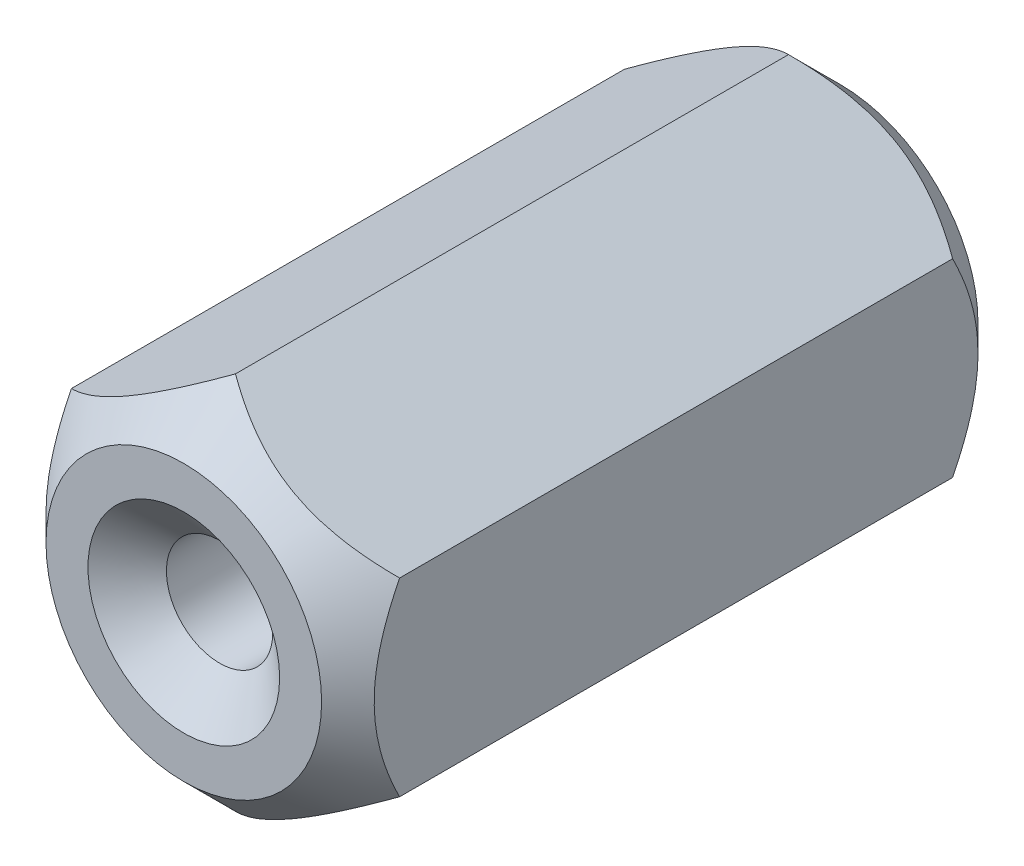
ISO-10303-21;
HEADER;
FILE_DESCRIPTION(('STEP AP214'),'2;1');
FILE_NAME('part.step','',(''),(''),'','','');
FILE_SCHEMA(('AUTOMOTIVE_DESIGN { 1 0 10303 214 1 1 1 1 }'));
ENDSEC;
DATA;
#1=APPLICATION_CONTEXT('core data for automotive mechanical design processes');
#2=APPLICATION_PROTOCOL_DEFINITION('international standard','automotive_design',2000,#1);
#3=PRODUCT_CONTEXT('',#1,'mechanical');
#4=PRODUCT('Part','Part','',(#3));
#5=PRODUCT_RELATED_PRODUCT_CATEGORY('part','',(#4));
#6=PRODUCT_DEFINITION_FORMATION('','',#4);
#7=PRODUCT_DEFINITION_CONTEXT('part definition',#1,'design');
#8=PRODUCT_DEFINITION('design','',#6,#7);
#9=PRODUCT_DEFINITION_SHAPE('','',#8);
#10=(LENGTH_UNIT() NAMED_UNIT(*) SI_UNIT(.MILLI.,.METRE.));
#11=(NAMED_UNIT(*) PLANE_ANGLE_UNIT() SI_UNIT($,.RADIAN.));
#12=(NAMED_UNIT(*) SI_UNIT($,.STERADIAN.) SOLID_ANGLE_UNIT());
#13=UNCERTAINTY_MEASURE_WITH_UNIT(LENGTH_MEASURE(1.E-05),#10,'distance_accuracy_value','');
#14=(GEOMETRIC_REPRESENTATION_CONTEXT(3) GLOBAL_UNCERTAINTY_ASSIGNED_CONTEXT((#13)) GLOBAL_UNIT_ASSIGNED_CONTEXT((#10,
#11,#12)) REPRESENTATION_CONTEXT('',''));
#15=CARTESIAN_POINT('',(0.,0.,0.));
#16=DIRECTION('',(0.,0.,1.));
#17=DIRECTION('',(1.,0.,0.));
#18=AXIS2_PLACEMENT_3D('',#15,#16,#17);
#19=CARTESIAN_POINT('',(0.,-3.66617420935412,-6.35));
#20=DIRECTION('',(0.5,-0.866025403784439,0.));
#21=DIRECTION('',(0.866025403784439,0.5,0.));
#22=AXIS2_PLACEMENT_3D('',#19,#20,#21);
#23=PLANE('',#22);
#24=CARTESIAN_POINT('',(3.1752,-1.83297163462322,-5.34988452449106));
#25=CARTESIAN_POINT('',(3.06606165005017,-1.89598269034567,-5.41284101630822));
#26=CARTESIAN_POINT('',(2.95509837192205,-1.9600473688431,-5.47209989576525));
#27=CARTESIAN_POINT('',(2.72883215365405,-2.09068223086865,-5.58060134426944));
#28=CARTESIAN_POINT('',(2.61350769674773,-2.15726483710766,-5.62978354606129));
#29=CARTESIAN_POINT('',(2.38096147751937,-2.29152545937819,-5.71403354112599));
#30=CARTESIAN_POINT('',(2.26379893371885,-2.35916928558036,-5.74931308550055));
#31=CARTESIAN_POINT('',(2.02689455535371,-2.49594609220167,-5.80366842986518));
#32=CARTESIAN_POINT('',(1.90715995735644,-2.56507489458671,-5.82278480247036));
#33=CARTESIAN_POINT('',(1.70080208124841,-2.68421566990708,-5.84003286937675));
#34=CARTESIAN_POINT('',(1.61444529227084,-2.73407378526963,-5.84258606638617));
#35=CARTESIAN_POINT('',(1.44187218347527,-2.83370891608764,-5.83828372687673));
#36=CARTESIAN_POINT('',(1.35565592350718,-2.88348589698874,-5.83142489197855));
#37=CARTESIAN_POINT('',(1.18404020841286,-2.98256827629562,-5.80869011669629));
#38=CARTESIAN_POINT('',(1.09864177574671,-3.03187308438379,-5.79280409031271));
#39=CARTESIAN_POINT('',(0.929311596694509,-3.12963590884151,-5.75288201600204));
#40=CARTESIAN_POINT('',(0.845379738380234,-3.17809398983284,-5.72884659291482));
#41=CARTESIAN_POINT('',(0.696376420715867,-3.26412109539651,-5.67939476558282));
#42=CARTESIAN_POINT('',(0.630975148808252,-3.30188053733772,-5.655278280699));
#43=CARTESIAN_POINT('',(0.50134674979488,-3.37672152840271,-5.60315853286284));
#44=CARTESIAN_POINT('',(0.437119658558265,-3.41380305681743,-5.57515515139647));
#45=CARTESIAN_POINT('',(0.310041965487392,-3.4871713971199,-5.51588943445548));
#46=CARTESIAN_POINT('',(0.247187749251269,-3.52346029578353,-5.48463734664579));
#47=CARTESIAN_POINT('',(0.122643379151904,-3.59536602138645,-5.41928465560806));
#48=CARTESIAN_POINT('',(0.0609525390212889,-3.63098324454239,-5.38518580048145));
#49=CARTESIAN_POINT('',(-0.000200000000000083,-3.66628967940796,-5.34988452449106));
#50=B_SPLINE_CURVE_WITH_KNOTS('',3,(#24,#25,#26,#27,#28,#29,#30,#31,#32,#33,#34,#35,#36,#37,#38,
#39,#40,#41,#42,#43,#44,#45,#46,#47,#48,#49),.UNSPECIFIED.,.F.,.F.,(4,2,2,2,2,2,2,2,2,2,2,2,4),
(0.,0.422910572436809,0.848285055427811,1.26690402276128,1.68446903107507,1.98329272958353,
2.28222117546891,2.58148426995467,2.88072442418454,3.11844134429547,3.35616551414406,
3.59316134346767,3.83001269744429),.UNSPECIFIED.);
#51=CARTESIAN_POINT('',(3.175,-1.83308710467706,-5.35));
#52=VERTEX_POINT('',#51);
#53=CARTESIAN_POINT('',(0.,-3.66617420935412,-5.35));
#54=VERTEX_POINT('',#53);
#55=EDGE_CURVE('E195',#52,#54,#50,.T.);
#56=ORIENTED_EDGE('',*,*,#55,.F.);
#57=DIRECTION('',(0.,0.,1.));
#58=VECTOR('',#57,1.);
#59=CARTESIAN_POINT('',(3.175,-1.83308710467706,-6.35));
#60=LINE('',#59,#58);
#61=CARTESIAN_POINT('',(3.175,-1.83308710467706,5.35));
#62=VERTEX_POINT('',#61);
#63=EDGE_CURVE('E36',#52,#62,#60,.T.);
#64=ORIENTED_EDGE('',*,*,#63,.T.);
#65=CARTESIAN_POINT('',(-0.000200000000000596,-3.66628967940796,5.34988452449106));
#66=CARTESIAN_POINT('',(0.108938349949826,-3.60327862368552,5.41284101630822));
#67=CARTESIAN_POINT('',(0.219901628077946,-3.53921394518808,5.47209989576525));
#68=CARTESIAN_POINT('',(0.446167846345949,-3.40857908316253,5.58060134426944));
#69=CARTESIAN_POINT('',(0.561492303252266,-3.34199647692352,5.62978354606129));
#70=CARTESIAN_POINT('',(0.79403852248063,-3.207735854653,5.714033541126));
#71=CARTESIAN_POINT('',(0.911201066281155,-3.14009202845082,5.74931308550055));
#72=CARTESIAN_POINT('',(1.14810544464629,-3.00331522182951,5.80366842986518));
#73=CARTESIAN_POINT('',(1.26784004264356,-2.93418641944448,5.82278480247036));
#74=CARTESIAN_POINT('',(1.47419791875159,-2.81504564412411,5.84003286937675));
#75=CARTESIAN_POINT('',(1.56055470772916,-2.76518752876155,5.84258606638617));
#76=CARTESIAN_POINT('',(1.73312781652473,-2.66555239794354,5.83828372687673));
#77=CARTESIAN_POINT('',(1.81934407649282,-2.61577541704245,5.83142489197855));
#78=CARTESIAN_POINT('',(1.99095979158714,-2.51669303773557,5.80869011669629));
#79=CARTESIAN_POINT('',(2.07635822425329,-2.46738822964739,5.79280409031271));
#80=CARTESIAN_POINT('',(2.24568840330549,-2.36962540518968,5.75288201600204));
#81=CARTESIAN_POINT('',(2.32962026161977,-2.32116732419835,5.72884659291482));
#82=CARTESIAN_POINT('',(2.47862357928413,-2.23514021863468,5.67939476558282));
#83=CARTESIAN_POINT('',(2.54402485119175,-2.19738077669347,5.655278280699));
#84=CARTESIAN_POINT('',(2.67365325020512,-2.12253978562848,5.60315853286284));
#85=CARTESIAN_POINT('',(2.73788034144173,-2.08545825721375,5.57515515139647));
#86=CARTESIAN_POINT('',(2.86495803451261,-2.01208991691129,5.51588943445548));
#87=CARTESIAN_POINT('',(2.92781225074873,-1.97580101824766,5.48463734664579));
#88=CARTESIAN_POINT('',(3.0523566208481,-1.90389529264474,5.41928465560806));
#89=CARTESIAN_POINT('',(3.11404746097871,-1.8682780694888,5.38518580048145));
#90=CARTESIAN_POINT('',(3.1752,-1.83297163462322,5.34988452449105));
#91=B_SPLINE_CURVE_WITH_KNOTS('',3,(#65,#66,#67,#68,#69,#70,#71,#72,#73,#74,#75,#76,#77,#78,#79,
#80,#81,#82,#83,#84,#85,#86,#87,#88,#89,#90),.UNSPECIFIED.,.F.,.F.,(4,2,2,2,2,2,2,2,2,2,2,2,4),
(0.,0.422910572436811,0.848285055427812,1.26690402276128,1.68446903107507,1.98329272958353,
2.28222117546892,2.58148426995467,2.88072442418454,3.11844134429548,3.35616551414406,
3.59316134346767,3.83001269744429),.UNSPECIFIED.);
#92=CARTESIAN_POINT('',(0.,-3.66617420935412,5.35));
#93=VERTEX_POINT('',#92);
#94=EDGE_CURVE('E116',#93,#62,#91,.T.);
#95=ORIENTED_EDGE('',*,*,#94,.F.);
#96=DIRECTION('',(0.,0.,1.));
#97=VECTOR('',#96,1.);
#98=CARTESIAN_POINT('',(0.,-3.66617420935412,-6.35));
#99=LINE('',#98,#97);
#100=EDGE_CURVE('E11',#54,#93,#99,.T.);
#101=ORIENTED_EDGE('',*,*,#100,.F.);
#102=EDGE_LOOP('',(#56,#64,#95,#101));
#103=FACE_BOUND('',#102,.T.);
#104=ADVANCED_FACE('F32',(#103),#23,.T.);
#105=CARTESIAN_POINT('',(-3.175,-1.83308710467706,-6.35));
#106=DIRECTION('',(-0.5,-0.866025403784439,0.));
#107=DIRECTION('',(0.866025403784439,-0.5,0.));
#108=AXIS2_PLACEMENT_3D('',#105,#106,#107);
#109=PLANE('',#108);
#110=CARTESIAN_POINT('',(0.000199999999999404,-3.66628967940796,-5.34988452449106));
#111=CARTESIAN_POINT('',(-0.108938349949827,-3.60327862368552,-5.41284101630822));
#112=CARTESIAN_POINT('',(-0.219901628077947,-3.53921394518808,-5.47209989576526));
#113=CARTESIAN_POINT('',(-0.44616784634595,-3.40857908316253,-5.58060134426944));
#114=CARTESIAN_POINT('',(-0.561492303252266,-3.34199647692352,-5.62978354606129));
#115=CARTESIAN_POINT('',(-0.794038522480631,-3.207735854653,-5.71403354112599));
#116=CARTESIAN_POINT('',(-0.911201066281155,-3.14009202845082,-5.74931308550055));
#117=CARTESIAN_POINT('',(-1.14810544464629,-3.00331522182951,-5.80366842986518));
#118=CARTESIAN_POINT('',(-1.26784004264356,-2.93418641944448,-5.82278480247036));
#119=CARTESIAN_POINT('',(-1.47419791875159,-2.81504564412411,-5.84003286937675));
#120=CARTESIAN_POINT('',(-1.56055470772916,-2.76518752876155,-5.84258606638617));
#121=CARTESIAN_POINT('',(-1.73312781652473,-2.66555239794354,-5.83828372687673));
#122=CARTESIAN_POINT('',(-1.81934407649282,-2.61577541704245,-5.83142489197855));
#123=CARTESIAN_POINT('',(-1.99095979158714,-2.51669303773556,-5.80869011669629));
#124=CARTESIAN_POINT('',(-2.07635822425329,-2.46738822964739,-5.79280409031272));
#125=CARTESIAN_POINT('',(-2.24568840330549,-2.36962540518968,-5.75288201600204));
#126=CARTESIAN_POINT('',(-2.32962026161977,-2.32116732419835,-5.72884659291482));
#127=CARTESIAN_POINT('',(-2.47862357928413,-2.23514021863468,-5.67939476558283));
#128=CARTESIAN_POINT('',(-2.54402485119175,-2.19738077669347,-5.655278280699));
#129=CARTESIAN_POINT('',(-2.67365325020512,-2.12253978562848,-5.60315853286284));
#130=CARTESIAN_POINT('',(-2.73788034144173,-2.08545825721375,-5.57515515139647));
#131=CARTESIAN_POINT('',(-2.86495803451261,-2.01208991691129,-5.51588943445549));
#132=CARTESIAN_POINT('',(-2.92781225074873,-1.97580101824766,-5.48463734664579));
#133=CARTESIAN_POINT('',(-3.0523566208481,-1.90389529264474,-5.41928465560807));
#134=CARTESIAN_POINT('',(-3.11404746097871,-1.86827806948879,-5.38518580048146));
#135=CARTESIAN_POINT('',(-3.1752,-1.83297163462322,-5.34988452449106));
#136=B_SPLINE_CURVE_WITH_KNOTS('',3,(#110,#111,#112,#113,#114,#115,#116,#117,#118,#119,#120,
#121,#122,#123,#124,#125,#126,#127,#128,#129,#130,#131,#132,#133,#134,#135),.UNSPECIFIED.,.F.,
.F.,(4,2,2,2,2,2,2,2,2,2,2,2,4),(0.,0.42291057243681,0.848285055427812,1.26690402276128,
1.68446903107507,1.98329272958353,2.28222117546892,2.58148426995467,2.88072442418454,
3.11844134429547,3.35616551414406,3.59316134346767,3.83001269744429),.UNSPECIFIED.);
#137=CARTESIAN_POINT('',(-3.175,-1.83308710467706,-5.35));
#138=VERTEX_POINT('',#137);
#139=EDGE_CURVE('E91',#54,#138,#136,.T.);
#140=ORIENTED_EDGE('',*,*,#139,.F.);
#141=ORIENTED_EDGE('',*,*,#100,.T.);
#142=CARTESIAN_POINT('',(-3.1752,-1.83297163462322,5.34988452449106));
#143=CARTESIAN_POINT('',(-3.06606165005017,-1.89598269034567,5.41284101630822));
#144=CARTESIAN_POINT('',(-2.95509837192205,-1.9600473688431,5.47209989576525));
#145=CARTESIAN_POINT('',(-2.72883215365405,-2.09068223086865,5.58060134426944));
#146=CARTESIAN_POINT('',(-2.61350769674773,-2.15726483710766,5.62978354606129));
#147=CARTESIAN_POINT('',(-2.38096147751937,-2.29152545937819,5.714033541126));
#148=CARTESIAN_POINT('',(-2.26379893371885,-2.35916928558036,5.74931308550055));
#149=CARTESIAN_POINT('',(-2.02689455535372,-2.49594609220167,5.80366842986518));
#150=CARTESIAN_POINT('',(-1.90715995735644,-2.56507489458671,5.82278480247036));
#151=CARTESIAN_POINT('',(-1.70080208124841,-2.68421566990708,5.84003286937675));
#152=CARTESIAN_POINT('',(-1.61444529227084,-2.73407378526963,5.84258606638617));
#153=CARTESIAN_POINT('',(-1.44187218347528,-2.83370891608764,5.83828372687673));
#154=CARTESIAN_POINT('',(-1.35565592350719,-2.88348589698874,5.83142489197855));
#155=CARTESIAN_POINT('',(-1.18404020841286,-2.98256827629562,5.80869011669629));
#156=CARTESIAN_POINT('',(-1.09864177574671,-3.03187308438379,5.79280409031272));
#157=CARTESIAN_POINT('',(-0.929311596694513,-3.12963590884151,5.75288201600204));
#158=CARTESIAN_POINT('',(-0.845379738380237,-3.17809398983284,5.72884659291482));
#159=CARTESIAN_POINT('',(-0.696376420715871,-3.26412109539651,5.67939476558283));
#160=CARTESIAN_POINT('',(-0.630975148808255,-3.30188053733771,5.655278280699));
#161=CARTESIAN_POINT('',(-0.501346749794882,-3.3767215284027,5.60315853286284));
#162=CARTESIAN_POINT('',(-0.437119658558267,-3.41380305681743,5.57515515139647));
#163=CARTESIAN_POINT('',(-0.310041965487393,-3.4871713971199,5.51588943445549));
#164=CARTESIAN_POINT('',(-0.247187749251271,-3.52346029578352,5.48463734664579));
#165=CARTESIAN_POINT('',(-0.122643379151905,-3.59536602138645,5.41928465560806));
#166=CARTESIAN_POINT('',(-0.0609525390212896,-3.63098324454239,5.38518580048145));
#167=CARTESIAN_POINT('',(0.000199999999999347,-3.66628967940796,5.34988452449106));
#168=B_SPLINE_CURVE_WITH_KNOTS('',3,(#142,#143,#144,#145,#146,#147,#148,#149,#150,#151,#152,
#153,#154,#155,#156,#157,#158,#159,#160,#161,#162,#163,#164,#165,#166,#167),.UNSPECIFIED.,.F.,
.F.,(4,2,2,2,2,2,2,2,2,2,2,2,4),(0.,0.422910572436809,0.84828505542781,1.26690402276128,
1.68446903107507,1.98329272958352,2.28222117546891,2.58148426995467,2.88072442418453,
3.11844134429547,3.35616551414406,3.59316134346767,3.83001269744429),.UNSPECIFIED.);
#169=CARTESIAN_POINT('',(-3.175,-1.83308710467706,5.35));
#170=VERTEX_POINT('',#169);
#171=EDGE_CURVE('E117',#170,#93,#168,.T.);
#172=ORIENTED_EDGE('',*,*,#171,.F.);
#173=DIRECTION('',(0.,0.,1.));
#174=VECTOR('',#173,1.);
#175=CARTESIAN_POINT('',(-3.175,-1.83308710467706,-6.35));
#176=LINE('',#175,#174);
#177=EDGE_CURVE('E41',#138,#170,#176,.T.);
#178=ORIENTED_EDGE('',*,*,#177,.F.);
#179=EDGE_LOOP('',(#140,#141,#172,#178));
#180=FACE_BOUND('',#179,.T.);
#181=ADVANCED_FACE('F176',(#180),#109,.T.);
#182=CARTESIAN_POINT('',(-3.175,1.83308710467706,-6.35));
#183=DIRECTION('',(-1.,0.,0.));
#184=DIRECTION('',(0.,-1.,0.));
#185=AXIS2_PLACEMENT_3D('',#182,#183,#184);
#186=PLANE('',#185);
#187=CARTESIAN_POINT('',(-3.175,-3.62314366162436,-4.19872727215091));
#188=CARTESIAN_POINT('',(-3.175,-3.53477477471413,-4.26517330066197));
#189=CARTESIAN_POINT('',(-3.175,-3.44590747401783,-4.33096732929088));
#190=CARTESIAN_POINT('',(-3.175,-3.26698086109358,-4.46096065674581));
#191=CARTESIAN_POINT('',(-3.175,-3.17692125186334,-4.52515954631578));
#192=CARTESIAN_POINT('',(-3.175,-2.9947562299698,-4.65212801376402));
#193=CARTESIAN_POINT('',(-3.175,-2.90264037042889,-4.71488265440275));
#194=CARTESIAN_POINT('',(-3.175,-2.71683951537136,-4.8380168325571));
#195=CARTESIAN_POINT('',(-3.175,-2.62315463201829,-4.89839653882316));
#196=CARTESIAN_POINT('',(-3.175,-2.42867521304995,-5.01955311497214));
#197=CARTESIAN_POINT('',(-3.175,-2.327776197965,-5.08016312895682));
#198=CARTESIAN_POINT('',(-3.175,-2.1236266416231,-5.19734891241029));
#199=CARTESIAN_POINT('',(-3.175,-2.02037573570296,-5.25392405057173));
#200=CARTESIAN_POINT('',(-3.175,-1.81153946353305,-5.36181638181168));
#201=CARTESIAN_POINT('',(-3.175,-1.70596214797143,-5.41314903574252));
#202=CARTESIAN_POINT('',(-3.175,-1.49194968831593,-5.50940753599678));
#203=CARTESIAN_POINT('',(-3.175,-1.38351585328126,-5.55433625855787));
#204=CARTESIAN_POINT('',(-3.175,-1.17206906194383,-5.63305402653428));
#205=CARTESIAN_POINT('',(-3.175,-1.06927808219159,-5.6674331189904));
#206=CARTESIAN_POINT('',(-3.175,-0.861249989752693,-5.72794018821902));
#207=CARTESIAN_POINT('',(-3.175,-0.756012706347597,-5.75406758726936));
#208=CARTESIAN_POINT('',(-3.175,-0.545455116385145,-5.79628154980003));
#209=CARTESIAN_POINT('',(-3.175,-0.440169465308187,-5.81253816718227));
#210=CARTESIAN_POINT('',(-3.175,-0.228508692793317,-5.83470019179704));
#211=CARTESIAN_POINT('',(-3.175,-0.122133754622792,-5.84060731241113));
#212=CARTESIAN_POINT('',(-3.175,0.0869577968377134,-5.84164473816365));
#213=CARTESIAN_POINT('',(-3.175,0.189672720284837,-5.83714340706931));
#214=CARTESIAN_POINT('',(-3.175,0.394206632826209,-5.81841780352249));
#215=CARTESIAN_POINT('',(-3.175,0.496025532914315,-5.80419257595037));
#216=CARTESIAN_POINT('',(-3.175,0.699751411908735,-5.76654774602645));
#217=CARTESIAN_POINT('',(-3.175,0.80162922915897,-5.7429728022883));
#218=CARTESIAN_POINT('',(-3.175,1.00316901022372,-5.68787603830061));
#219=CARTESIAN_POINT('',(-3.175,1.10283116972946,-5.65635492293116));
#220=CARTESIAN_POINT('',(-3.175,1.30972972723242,-5.583139745003));
#221=CARTESIAN_POINT('',(-3.175,1.41671377003006,-5.54073954984725));
#222=CARTESIAN_POINT('',(-3.175,1.62788222750015,-5.4494455092361));
#223=CARTESIAN_POINT('',(-3.175,1.73206568079257,-5.40054946728032));
#224=CARTESIAN_POINT('',(-3.175,1.93816752656033,-5.2974201972936));
#225=CARTESIAN_POINT('',(-3.175,2.04007726416977,-5.24316981162604));
#226=CARTESIAN_POINT('',(-3.175,2.24154914453307,-5.13053481703511));
#227=CARTESIAN_POINT('',(-3.175,2.34111165997837,-5.07215087041164));
#228=CARTESIAN_POINT('',(-3.175,2.53328789139579,-4.95505822864378));
#229=CARTESIAN_POINT('',(-3.175,2.62600050272272,-4.89651098750221));
#230=CARTESIAN_POINT('',(-3.175,2.80983442239984,-4.77696182904577));
#231=CARTESIAN_POINT('',(-3.175,2.90095560921207,-4.71595972541707));
#232=CARTESIAN_POINT('',(-3.175,3.08107470813498,-4.59244540123562));
#233=CARTESIAN_POINT('',(-3.175,3.1700838687153,-4.52994952545103));
#234=CARTESIAN_POINT('',(-3.175,3.34688695470738,-4.40331054967444));
#235=CARTESIAN_POINT('',(-3.175,3.43468120733686,-4.33916790704841));
#236=CARTESIAN_POINT('',(-3.175,3.52196693533842,-4.27435218679602));
#237=B_SPLINE_CURVE_WITH_KNOTS('',3,(#187,#188,#189,#190,#191,#192,#193,#194,#195,#196,#197,
#198,#199,#200,#201,#202,#203,#204,#205,#206,#207,#208,#209,#210,#211,#212,#213,#214,#215,#216,
#217,#218,#219,#220,#221,#222,#223,#224,#225,#226,#227,#228,#229,#230,#231,#232,#233,#234,#235,
#236),.UNSPECIFIED.,.F.,.F.,(4,2,2,2,2,2,2,2,2,2,2,2,2,2,2,2,2,2,2,2,2,2,2,2,4),(0.,
0.331695086033258,0.663474412411204,0.997825593478522,1.33215297421855,1.68518935827853,
2.03828085871132,2.39029899374214,2.74215852308448,3.06703502033416,3.39193425797894,
3.71106436530982,4.03014163496714,4.33810010599997,4.64608883028139,4.9594247376372,
5.27273285971666,5.6177025492793,5.96278918493366,6.30901993384334,6.65519533292016,
6.98410375942931,7.31303719597191,7.63929174244195,7.96545663622253),.UNSPECIFIED.);
#238=CARTESIAN_POINT('',(-3.175,1.83308710467706,-5.35));
#239=VERTEX_POINT('',#238);
#240=EDGE_CURVE('E85',#138,#239,#237,.T.);
#241=ORIENTED_EDGE('',*,*,#240,.F.);
#242=ORIENTED_EDGE('',*,*,#177,.T.);
#243=CARTESIAN_POINT('',(-3.175,-3.62314366162436,4.19872727215091));
#244=CARTESIAN_POINT('',(-3.175,-3.53477477471413,4.26517330066197));
#245=CARTESIAN_POINT('',(-3.175,-3.44590747401783,4.33096732929088));
#246=CARTESIAN_POINT('',(-3.175,-3.26698086109358,4.46096065674581));
#247=CARTESIAN_POINT('',(-3.175,-3.17692125186334,4.52515954631578));
#248=CARTESIAN_POINT('',(-3.175,-2.9947562299698,4.65212801376402));
#249=CARTESIAN_POINT('',(-3.175,-2.90264037042889,4.71488265440275));
#250=CARTESIAN_POINT('',(-3.175,-2.71683951537136,4.8380168325571));
#251=CARTESIAN_POINT('',(-3.175,-2.62315463201829,4.89839653882316));
#252=CARTESIAN_POINT('',(-3.175,-2.42867521304995,5.01955311497214));
#253=CARTESIAN_POINT('',(-3.175,-2.327776197965,5.08016312895682));
#254=CARTESIAN_POINT('',(-3.175,-2.1236266416231,5.19734891241029));
#255=CARTESIAN_POINT('',(-3.175,-2.02037573570296,5.25392405057173));
#256=CARTESIAN_POINT('',(-3.175,-1.81153946353305,5.36181638181168));
#257=CARTESIAN_POINT('',(-3.175,-1.70596214797143,5.41314903574252));
#258=CARTESIAN_POINT('',(-3.175,-1.49194968831593,5.50940753599678));
#259=CARTESIAN_POINT('',(-3.175,-1.38351585328126,5.55433625855787));
#260=CARTESIAN_POINT('',(-3.175,-1.17206906194383,5.63305402653428));
#261=CARTESIAN_POINT('',(-3.175,-1.06927808219159,5.6674331189904));
#262=CARTESIAN_POINT('',(-3.175,-0.861249989752693,5.72794018821902));
#263=CARTESIAN_POINT('',(-3.175,-0.756012706347597,5.75406758726936));
#264=CARTESIAN_POINT('',(-3.175,-0.545455116385145,5.79628154980003));
#265=CARTESIAN_POINT('',(-3.175,-0.440169465308187,5.81253816718227));
#266=CARTESIAN_POINT('',(-3.175,-0.228508692793317,5.83470019179704));
#267=CARTESIAN_POINT('',(-3.175,-0.122133754622792,5.84060731241113));
#268=CARTESIAN_POINT('',(-3.175,0.0869577968377134,5.84164473816365));
#269=CARTESIAN_POINT('',(-3.175,0.189672720284837,5.83714340706931));
#270=CARTESIAN_POINT('',(-3.175,0.394206632826209,5.81841780352249));
#271=CARTESIAN_POINT('',(-3.175,0.496025532914315,5.80419257595037));
#272=CARTESIAN_POINT('',(-3.175,0.699751411908735,5.76654774602645));
#273=CARTESIAN_POINT('',(-3.175,0.80162922915897,5.7429728022883));
#274=CARTESIAN_POINT('',(-3.175,1.00316901022372,5.68787603830061));
#275=CARTESIAN_POINT('',(-3.175,1.10283116972946,5.65635492293116));
#276=CARTESIAN_POINT('',(-3.175,1.30972972723242,5.583139745003));
#277=CARTESIAN_POINT('',(-3.175,1.41671377003006,5.54073954984725));
#278=CARTESIAN_POINT('',(-3.175,1.62788222750015,5.4494455092361));
#279=CARTESIAN_POINT('',(-3.175,1.73206568079257,5.40054946728032));
#280=CARTESIAN_POINT('',(-3.175,1.93816752656033,5.2974201972936));
#281=CARTESIAN_POINT('',(-3.175,2.04007726416977,5.24316981162604));
#282=CARTESIAN_POINT('',(-3.175,2.24154914453307,5.13053481703511));
#283=CARTESIAN_POINT('',(-3.175,2.34111165997837,5.07215087041164));
#284=CARTESIAN_POINT('',(-3.175,2.53328789139579,4.95505822864378));
#285=CARTESIAN_POINT('',(-3.175,2.62600050272272,4.89651098750221));
#286=CARTESIAN_POINT('',(-3.175,2.80983442239984,4.77696182904577));
#287=CARTESIAN_POINT('',(-3.175,2.90095560921207,4.71595972541707));
#288=CARTESIAN_POINT('',(-3.175,3.08107470813498,4.59244540123562));
#289=CARTESIAN_POINT('',(-3.175,3.1700838687153,4.52994952545103));
#290=CARTESIAN_POINT('',(-3.175,3.34688695470738,4.40331054967444));
#291=CARTESIAN_POINT('',(-3.175,3.43468120733686,4.33916790704841));
#292=CARTESIAN_POINT('',(-3.175,3.52196693533842,4.27435218679602));
#293=B_SPLINE_CURVE_WITH_KNOTS('',3,(#243,#244,#245,#246,#247,#248,#249,#250,#251,#252,#253,
#254,#255,#256,#257,#258,#259,#260,#261,#262,#263,#264,#265,#266,#267,#268,#269,#270,#271,#272,
#273,#274,#275,#276,#277,#278,#279,#280,#281,#282,#283,#284,#285,#286,#287,#288,#289,#290,#291,
#292),.UNSPECIFIED.,.F.,.F.,(4,2,2,2,2,2,2,2,2,2,2,2,2,2,2,2,2,2,2,2,2,2,2,2,4),(0.,
0.331695086033258,0.663474412411204,0.997825593478522,1.33215297421855,1.68518935827853,
2.03828085871132,2.39029899374214,2.74215852308448,3.06703502033416,3.39193425797894,
3.71106436530982,4.03014163496714,4.33810010599997,4.64608883028139,4.9594247376372,
5.27273285971666,5.6177025492793,5.96278918493366,6.30901993384334,6.65519533292016,
6.98410375942931,7.31303719597191,7.63929174244195,7.96545663622253),.UNSPECIFIED.);
#294=CARTESIAN_POINT('',(-3.175,1.83308710467706,5.35));
#295=VERTEX_POINT('',#294);
#296=EDGE_CURVE('E107',#295,#170,#293,.F.);
#297=ORIENTED_EDGE('',*,*,#296,.F.);
#298=DIRECTION('',(0.,0.,1.));
#299=VECTOR('',#298,1.);
#300=CARTESIAN_POINT('',(-3.175,1.83308710467706,-6.35));
#301=LINE('',#300,#299);
#302=EDGE_CURVE('E100',#239,#295,#301,.T.);
#303=ORIENTED_EDGE('',*,*,#302,.F.);
#304=EDGE_LOOP('',(#241,#242,#297,#303));
#305=FACE_BOUND('',#304,.T.);
#306=ADVANCED_FACE('F105',(#305),#186,.T.);
#307=CARTESIAN_POINT('',(0.,3.66617420935412,-6.35));
#308=DIRECTION('',(-0.5,0.866025403784439,0.));
#309=DIRECTION('',(-0.866025403784439,-0.5,0.));
#310=AXIS2_PLACEMENT_3D('',#307,#308,#309);
#311=PLANE('',#310);
#312=CARTESIAN_POINT('',(-3.1752,1.83297163462323,-5.34988452449106));
#313=CARTESIAN_POINT('',(-3.06606165005017,1.89598269034567,-5.41284101630822));
#314=CARTESIAN_POINT('',(-2.95509837192205,1.9600473688431,-5.47209989576525));
#315=CARTESIAN_POINT('',(-2.72883215365405,2.09068223086865,-5.58060134426944));
#316=CARTESIAN_POINT('',(-2.61350769674773,2.15726483710766,-5.62978354606129));
#317=CARTESIAN_POINT('',(-2.38096147751937,2.29152545937819,-5.71403354112599));
#318=CARTESIAN_POINT('',(-2.26379893371885,2.35916928558036,-5.74931308550055));
#319=CARTESIAN_POINT('',(-2.02689455535371,2.49594609220167,-5.80366842986518));
#320=CARTESIAN_POINT('',(-1.90715995735644,2.56507489458671,-5.82278480247036));
#321=CARTESIAN_POINT('',(-1.70080208124841,2.68421566990708,-5.84003286937675));
#322=CARTESIAN_POINT('',(-1.61444529227084,2.73407378526963,-5.84258606638617));
#323=CARTESIAN_POINT('',(-1.44187218347527,2.83370891608764,-5.83828372687673));
#324=CARTESIAN_POINT('',(-1.35565592350719,2.88348589698874,-5.83142489197855));
#325=CARTESIAN_POINT('',(-1.18404020841286,2.98256827629562,-5.80869011669629));
#326=CARTESIAN_POINT('',(-1.09864177574671,3.03187308438379,-5.79280409031271));
#327=CARTESIAN_POINT('',(-0.929311596694511,3.12963590884151,-5.75288201600204));
#328=CARTESIAN_POINT('',(-0.845379738380236,3.17809398983284,-5.72884659291482));
#329=CARTESIAN_POINT('',(-0.696376420715869,3.26412109539651,-5.67939476558283));
#330=CARTESIAN_POINT('',(-0.630975148808253,3.30188053733771,-5.655278280699));
#331=CARTESIAN_POINT('',(-0.501346749794881,3.3767215284027,-5.60315853286284));
#332=CARTESIAN_POINT('',(-0.437119658558266,3.41380305681743,-5.57515515139647));
#333=CARTESIAN_POINT('',(-0.310041965487392,3.4871713971199,-5.51588943445549));
#334=CARTESIAN_POINT('',(-0.247187749251269,3.52346029578352,-5.48463734664579));
#335=CARTESIAN_POINT('',(-0.122643379151903,3.59536602138645,-5.41928465560806));
#336=CARTESIAN_POINT('',(-0.0609525390212879,3.63098324454239,-5.38518580048145));
#337=CARTESIAN_POINT('',(0.000200000000001174,3.66628967940796,-5.34988452449106));
#338=B_SPLINE_CURVE_WITH_KNOTS('',3,(#312,#313,#314,#315,#316,#317,#318,#319,#320,#321,#322,
#323,#324,#325,#326,#327,#328,#329,#330,#331,#332,#333,#334,#335,#336,#337),.UNSPECIFIED.,.F.,
.F.,(4,2,2,2,2,2,2,2,2,2,2,2,4),(0.,0.422910572436809,0.84828505542781,1.26690402276128,
1.68446903107507,1.98329272958352,2.28222117546891,2.58148426995467,2.88072442418453,
3.11844134429547,3.35616551414406,3.59316134346767,3.83001269744429),.UNSPECIFIED.);
#339=CARTESIAN_POINT('',(0.,3.66617420935412,-5.35));
#340=VERTEX_POINT('',#339);
#341=EDGE_CURVE('E89',#239,#340,#338,.T.);
#342=ORIENTED_EDGE('',*,*,#341,.F.);
#343=ORIENTED_EDGE('',*,*,#302,.T.);
#344=CARTESIAN_POINT('',(0.000200000000001491,3.66628967940796,5.34988452449106));
#345=CARTESIAN_POINT('',(-0.108938349949825,3.60327862368552,5.41284101630822));
#346=CARTESIAN_POINT('',(-0.219901628077945,3.53921394518808,5.47209989576526));
#347=CARTESIAN_POINT('',(-0.446167846345947,3.40857908316253,5.58060134426944));
#348=CARTESIAN_POINT('',(-0.561492303252264,3.34199647692353,5.62978354606129));
#349=CARTESIAN_POINT('',(-0.794038522480629,3.207735854653,5.71403354112599));
#350=CARTESIAN_POINT('',(-0.911201066281153,3.14009202845083,5.74931308550055));
#351=CARTESIAN_POINT('',(-1.14810544464628,3.00331522182952,5.80366842986518));
#352=CARTESIAN_POINT('',(-1.26784004264356,2.93418641944448,5.82278480247036));
#353=CARTESIAN_POINT('',(-1.47419791875159,2.81504564412411,5.84003286937675));
#354=CARTESIAN_POINT('',(-1.56055470772916,2.76518752876155,5.84258606638617));
#355=CARTESIAN_POINT('',(-1.73312781652473,2.66555239794355,5.83828372687673));
#356=CARTESIAN_POINT('',(-1.81934407649281,2.61577541704245,5.83142489197855));
#357=CARTESIAN_POINT('',(-1.99095979158714,2.51669303773557,5.80869011669629));
#358=CARTESIAN_POINT('',(-2.07635822425329,2.4673882296474,5.79280409031271));
#359=CARTESIAN_POINT('',(-2.24568840330549,2.36962540518968,5.75288201600204));
#360=CARTESIAN_POINT('',(-2.32962026161976,2.32116732419835,5.72884659291482));
#361=CARTESIAN_POINT('',(-2.47862357928413,2.23514021863468,5.67939476558282));
#362=CARTESIAN_POINT('',(-2.54402485119175,2.19738077669347,5.655278280699));
#363=CARTESIAN_POINT('',(-2.67365325020512,2.12253978562848,5.60315853286284));
#364=CARTESIAN_POINT('',(-2.73788034144173,2.08545825721375,5.57515515139647));
#365=CARTESIAN_POINT('',(-2.86495803451261,2.01208991691129,5.51588943445548));
#366=CARTESIAN_POINT('',(-2.92781225074873,1.97580101824766,5.48463734664579));
#367=CARTESIAN_POINT('',(-3.0523566208481,1.90389529264474,5.41928465560806));
#368=CARTESIAN_POINT('',(-3.11404746097871,1.8682780694888,5.38518580048145));
#369=CARTESIAN_POINT('',(-3.1752,1.83297163462323,5.34988452449106));
#370=B_SPLINE_CURVE_WITH_KNOTS('',3,(#344,#345,#346,#347,#348,#349,#350,#351,#352,#353,#354,
#355,#356,#357,#358,#359,#360,#361,#362,#363,#364,#365,#366,#367,#368,#369),.UNSPECIFIED.,.F.,
.F.,(4,2,2,2,2,2,2,2,2,2,2,2,4),(0.,0.42291057243681,0.848285055427811,1.26690402276128,
1.68446903107507,1.98329272958353,2.28222117546892,2.58148426995467,2.88072442418454,
3.11844134429548,3.35616551414406,3.59316134346767,3.83001269744429),.UNSPECIFIED.);
#371=CARTESIAN_POINT('',(0.,3.66617420935412,5.35));
#372=VERTEX_POINT('',#371);
#373=EDGE_CURVE('E163',#372,#295,#370,.T.);
#374=ORIENTED_EDGE('',*,*,#373,.F.);
#375=DIRECTION('',(0.,0.,1.));
#376=VECTOR('',#375,1.);
#377=CARTESIAN_POINT('',(0.,3.66617420935412,-6.35));
#378=LINE('',#377,#376);
#379=EDGE_CURVE('E102',#340,#372,#378,.T.);
#380=ORIENTED_EDGE('',*,*,#379,.F.);
#381=EDGE_LOOP('',(#342,#343,#374,#380));
#382=FACE_BOUND('',#381,.T.);
#383=ADVANCED_FACE('F98',(#382),#311,.T.);
#384=CARTESIAN_POINT('',(3.175,1.83308710467706,-6.35));
#385=DIRECTION('',(0.5,0.866025403784438,0.));
#386=DIRECTION('',(-0.866025403784438,0.5,0.));
#387=AXIS2_PLACEMENT_3D('',#384,#385,#386);
#388=PLANE('',#387);
#389=CARTESIAN_POINT('',(-0.000199999999998509,3.66628967940796,-5.34988452449105));
#390=CARTESIAN_POINT('',(0.108938349949828,3.60327862368552,-5.41284101630822));
#391=CARTESIAN_POINT('',(0.219901628077948,3.53921394518808,-5.47209989576525));
#392=CARTESIAN_POINT('',(0.446167846345951,3.40857908316253,-5.58060134426944));
#393=CARTESIAN_POINT('',(0.561492303252268,3.34199647692352,-5.62978354606129));
#394=CARTESIAN_POINT('',(0.794038522480632,3.207735854653,-5.71403354112599));
#395=CARTESIAN_POINT('',(0.911201066281157,3.14009202845082,-5.74931308550055));
#396=CARTESIAN_POINT('',(1.14810544464629,3.00331522182951,-5.80366842986518));
#397=CARTESIAN_POINT('',(1.26784004264356,2.93418641944448,-5.82278480247036));
#398=CARTESIAN_POINT('',(1.47419791875159,2.81504564412411,-5.84003286937675));
#399=CARTESIAN_POINT('',(1.56055470772917,2.76518752876155,-5.84258606638617));
#400=CARTESIAN_POINT('',(1.73312781652473,2.66555239794354,-5.83828372687673));
#401=CARTESIAN_POINT('',(1.81934407649282,2.61577541704245,-5.83142489197855));
#402=CARTESIAN_POINT('',(1.99095979158714,2.51669303773556,-5.80869011669629));
#403=CARTESIAN_POINT('',(2.07635822425329,2.46738822964739,-5.79280409031271));
#404=CARTESIAN_POINT('',(2.24568840330549,2.36962540518968,-5.75288201600204));
#405=CARTESIAN_POINT('',(2.32962026161977,2.32116732419834,-5.72884659291482));
#406=CARTESIAN_POINT('',(2.47862357928413,2.23514021863468,-5.67939476558282));
#407=CARTESIAN_POINT('',(2.54402485119175,2.19738077669347,-5.655278280699));
#408=CARTESIAN_POINT('',(2.67365325020512,2.12253978562848,-5.60315853286284));
#409=CARTESIAN_POINT('',(2.73788034144174,2.08545825721375,-5.57515515139647));
#410=CARTESIAN_POINT('',(2.86495803451261,2.01208991691129,-5.51588943445548));
#411=CARTESIAN_POINT('',(2.92781225074873,1.97580101824766,-5.48463734664579));
#412=CARTESIAN_POINT('',(3.0523566208481,1.90389529264474,-5.41928465560806));
#413=CARTESIAN_POINT('',(3.11404746097871,1.86827806948879,-5.38518580048145));
#414=CARTESIAN_POINT('',(3.1752,1.83297163462322,-5.34988452449106));
#415=B_SPLINE_CURVE_WITH_KNOTS('',3,(#389,#390,#391,#392,#393,#394,#395,#396,#397,#398,#399,
#400,#401,#402,#403,#404,#405,#406,#407,#408,#409,#410,#411,#412,#413,#414),.UNSPECIFIED.,.F.,
.F.,(4,2,2,2,2,2,2,2,2,2,2,2,4),(0.,0.422910572436811,0.848285055427812,1.26690402276128,
1.68446903107507,1.98329272958353,2.28222117546892,2.58148426995467,2.88072442418454,
3.11844134429547,3.35616551414406,3.59316134346767,3.83001269744429),.UNSPECIFIED.);
#416=CARTESIAN_POINT('',(3.175,1.83308710467706,-5.35));
#417=VERTEX_POINT('',#416);
#418=EDGE_CURVE('E49',#340,#417,#415,.T.);
#419=ORIENTED_EDGE('',*,*,#418,.F.);
#420=ORIENTED_EDGE('',*,*,#379,.T.);
#421=CARTESIAN_POINT('',(3.1752,1.83297163462322,5.34988452449106));
#422=CARTESIAN_POINT('',(3.06606165005017,1.89598269034567,5.41284101630822));
#423=CARTESIAN_POINT('',(2.95509837192205,1.9600473688431,5.47209989576525));
#424=CARTESIAN_POINT('',(2.72883215365405,2.09068223086865,5.58060134426944));
#425=CARTESIAN_POINT('',(2.61350769674773,2.15726483710766,5.62978354606129));
#426=CARTESIAN_POINT('',(2.38096147751937,2.29152545937819,5.714033541126));
#427=CARTESIAN_POINT('',(2.26379893371885,2.35916928558036,5.74931308550055));
#428=CARTESIAN_POINT('',(2.02689455535371,2.49594609220167,5.80366842986518));
#429=CARTESIAN_POINT('',(1.90715995735644,2.56507489458671,5.82278480247036));
#430=CARTESIAN_POINT('',(1.70080208124841,2.68421566990708,5.84003286937675));
#431=CARTESIAN_POINT('',(1.61444529227084,2.73407378526963,5.84258606638617));
#432=CARTESIAN_POINT('',(1.44187218347527,2.83370891608764,5.83828372687673));
#433=CARTESIAN_POINT('',(1.35565592350719,2.88348589698874,5.83142489197855));
#434=CARTESIAN_POINT('',(1.18404020841286,2.98256827629562,5.80869011669629));
#435=CARTESIAN_POINT('',(1.09864177574671,3.03187308438379,5.79280409031271));
#436=CARTESIAN_POINT('',(0.929311596694511,3.12963590884151,5.75288201600204));
#437=CARTESIAN_POINT('',(0.845379738380236,3.17809398983284,5.72884659291482));
#438=CARTESIAN_POINT('',(0.696376420715869,3.26412109539651,5.67939476558282));
#439=CARTESIAN_POINT('',(0.630975148808254,3.30188053733771,5.655278280699));
#440=CARTESIAN_POINT('',(0.501346749794882,3.37672152840271,5.60315853286284));
#441=CARTESIAN_POINT('',(0.437119658558267,3.41380305681743,5.57515515139647));
#442=CARTESIAN_POINT('',(0.310041965487394,3.4871713971199,5.51588943445548));
#443=CARTESIAN_POINT('',(0.247187749251271,3.52346029578353,5.48463734664579));
#444=CARTESIAN_POINT('',(0.122643379151905,3.59536602138645,5.41928465560806));
#445=CARTESIAN_POINT('',(0.0609525390212904,3.63098324454239,5.38518580048145));
#446=CARTESIAN_POINT('',(-0.000199999999998456,3.66628967940796,5.34988452449105));
#447=B_SPLINE_CURVE_WITH_KNOTS('',3,(#421,#422,#423,#424,#425,#426,#427,#428,#429,#430,#431,
#432,#433,#434,#435,#436,#437,#438,#439,#440,#441,#442,#443,#444,#445,#446),.UNSPECIFIED.,.F.,
.F.,(4,2,2,2,2,2,2,2,2,2,2,2,4),(0.,0.42291057243681,0.848285055427811,1.26690402276128,
1.68446903107507,1.98329272958353,2.28222117546892,2.58148426995467,2.88072442418453,
3.11844134429547,3.35616551414406,3.59316134346767,3.83001269744429),.UNSPECIFIED.);
#448=CARTESIAN_POINT('',(3.175,1.83308710467706,5.35));
#449=VERTEX_POINT('',#448);
#450=EDGE_CURVE('E155',#449,#372,#447,.T.);
#451=ORIENTED_EDGE('',*,*,#450,.F.);
#452=DIRECTION('',(0.,0.,1.));
#453=VECTOR('',#452,1.);
#454=CARTESIAN_POINT('',(3.175,1.83308710467706,-6.35));
#455=LINE('',#454,#453);
#456=EDGE_CURVE('E110',#417,#449,#455,.T.);
#457=ORIENTED_EDGE('',*,*,#456,.F.);
#458=EDGE_LOOP('',(#419,#420,#451,#457));
#459=FACE_BOUND('',#458,.T.);
#460=ADVANCED_FACE('F213',(#459),#388,.T.);
#461=CARTESIAN_POINT('',(3.175,-1.83308710467706,-6.35));
#462=DIRECTION('',(1.,0.,0.));
#463=DIRECTION('',(0.,0.,-1.));
#464=AXIS2_PLACEMENT_3D('',#461,#462,#463);
#465=PLANE('',#464);
#466=CARTESIAN_POINT('',(3.175,-3.62314366067579,-4.19872727286431));
#467=CARTESIAN_POINT('',(3.175,-3.53477477379202,-4.26517330134793));
#468=CARTESIAN_POINT('',(3.175,-3.44590747312225,-4.33096732994944));
#469=CARTESIAN_POINT('',(3.175,-3.26698086025134,-4.46096065734972));
#470=CARTESIAN_POINT('',(3.175,-3.17692125104791,-4.52515954689244));
#471=CARTESIAN_POINT('',(3.175,-2.99475622920889,-4.65212801428601));
#472=CARTESIAN_POINT('',(3.175,-2.9026403696957,-4.71488265489732));
#473=CARTESIAN_POINT('',(3.175,-2.71683951469412,-4.83801683299725));
#474=CARTESIAN_POINT('',(3.175,-2.62315463136928,-4.89839653923633));
#475=CARTESIAN_POINT('',(3.175,-2.42867521246179,-5.0195531153292));
#476=CARTESIAN_POINT('',(3.175,-2.32777619740955,-5.08016312928487));
#477=CARTESIAN_POINT('',(3.175,-2.12362664113426,-5.19734891268168));
#478=CARTESIAN_POINT('',(3.175,-2.02037573524801,-5.25392405081547));
#479=CARTESIAN_POINT('',(3.175,-1.81153946314711,-5.3618163820024));
#480=CARTESIAN_POINT('',(3.175,-1.7059621476206,-5.41314903590788));
#481=CARTESIAN_POINT('',(3.175,-1.49194968803719,-5.5094075361146));
#482=CARTESIAN_POINT('',(3.175,-1.3835158530395,-5.55433625865351));
#483=CARTESIAN_POINT('',(3.175,-1.17206906171815,-5.63305402661309));
#484=CARTESIAN_POINT('',(3.175,-1.0692780819434,-5.66743311907037));
#485=CARTESIAN_POINT('',(3.175,-0.861249989458809,-5.72794018829673));
#486=CARTESIAN_POINT('',(3.175,-0.756012706030513,-5.75406758734365));
#487=CARTESIAN_POINT('',(3.175,-0.545455116022437,-5.79628154986223));
#488=CARTESIAN_POINT('',(3.175,-0.440169464923066,-5.81253816723595));
#489=CARTESIAN_POINT('',(3.175,-0.228508692364151,-5.83470019182863));
#490=CARTESIAN_POINT('',(3.175,-0.122133754171996,-5.84060731242916));
#491=CARTESIAN_POINT('',(3.175,0.0869577973290809,-5.84164473815083));
#492=CARTESIAN_POINT('',(3.175,0.1896727207952,-5.83714340703938));
#493=CARTESIAN_POINT('',(3.175,0.394206633372702,-5.81841780345564));
#494=CARTESIAN_POINT('',(3.175,0.496025533477941,-5.80419257586372));
#495=CARTESIAN_POINT('',(3.175,0.699751412506188,-5.76654774589823));
#496=CARTESIAN_POINT('',(3.175,0.801629229773065,-5.74297280213821));
#497=CARTESIAN_POINT('',(3.175,1.00316901086953,-5.68787603810625));
#498=CARTESIAN_POINT('',(3.175,1.10283117039033,-5.65635492271443));
#499=CARTESIAN_POINT('',(3.175,1.30972972797288,-5.5831397447221));
#500=CARTESIAN_POINT('',(3.175,1.41671377083364,-5.54073954952092));
#501=CARTESIAN_POINT('',(3.175,1.62788222842673,-5.44944550881442));
#502=CARTESIAN_POINT('',(3.175,1.73206568177903,-5.40054946680869));
#503=CARTESIAN_POINT('',(3.175,1.93816752766441,-5.29742019671909));
#504=CARTESIAN_POINT('',(3.175,2.04007726533157,-5.24316981099857));
#505=CARTESIAN_POINT('',(3.175,2.24154914580843,-5.13053481630006));
#506=CARTESIAN_POINT('',(3.175,2.34111166130958,-5.072150869622));
#507=CARTESIAN_POINT('',(3.175,2.53328789282852,-4.95505822775043));
#508=CARTESIAN_POINT('',(3.175,2.62600050420133,-4.89651098656001));
#509=CARTESIAN_POINT('',(3.175,2.80983442396953,-4.77696182800565));
#510=CARTESIAN_POINT('',(3.175,2.90095561082698,-4.71595972432788));
#511=CARTESIAN_POINT('',(3.175,3.08107470983924,-4.59244540004885));
#512=CARTESIAN_POINT('',(3.175,3.17008387046369,-4.52994952421576));
#513=CARTESIAN_POINT('',(3.175,3.34688695654375,-4.40331054834222));
#514=CARTESIAN_POINT('',(3.175,3.43468120921709,-4.33916790566774));
#515=CARTESIAN_POINT('',(3.175,3.52196693726243,-4.27435218536698));
#516=B_SPLINE_CURVE_WITH_KNOTS('',3,(#466,#467,#468,#469,#470,#471,#472,#473,#474,#475,#476,
#477,#478,#479,#480,#481,#482,#483,#484,#485,#486,#487,#488,#489,#490,#491,#492,#493,#494,#495,
#496,#497,#498,#499,#500,#501,#502,#503,#504,#505,#506,#507,#508,#509,#510,#511,#512,#513,#514,
#515),.UNSPECIFIED.,.F.,.F.,(4,2,2,2,2,2,2,2,2,2,2,2,2,2,2,2,2,2,2,2,2,2,2,2,4),(0.,
0.331695085920362,0.663474412185376,0.997825593137643,1.33215297376264,1.68518935769371,
2.03828085799751,2.39029899290042,2.74215852211506,3.06703501942959,3.3919342571391,
3.71106436453215,4.03014163425164,4.33810010534342,4.64608882968384,4.95942473710304,
5.27273285924588,5.61770254903443,5.96278918491495,6.3090199340521,6.65519533335629,
6.98410376006005,7.31303719679728,7.6392917434593,7.96545663743185),.UNSPECIFIED.);
#517=EDGE_CURVE('E209',#417,#52,#516,.F.);
#518=ORIENTED_EDGE('',*,*,#517,.F.);
#519=ORIENTED_EDGE('',*,*,#456,.T.);
#520=CARTESIAN_POINT('',(3.175,-3.62314366067579,4.19872727286431));
#521=CARTESIAN_POINT('',(3.175,-3.53477477379202,4.26517330134793));
#522=CARTESIAN_POINT('',(3.175,-3.44590747312225,4.33096732994944));
#523=CARTESIAN_POINT('',(3.175,-3.26698086025134,4.46096065734972));
#524=CARTESIAN_POINT('',(3.175,-3.17692125104791,4.52515954689244));
#525=CARTESIAN_POINT('',(3.175,-2.99475622920889,4.65212801428601));
#526=CARTESIAN_POINT('',(3.175,-2.9026403696957,4.71488265489732));
#527=CARTESIAN_POINT('',(3.175,-2.71683951469412,4.83801683299725));
#528=CARTESIAN_POINT('',(3.175,-2.62315463136928,4.89839653923633));
#529=CARTESIAN_POINT('',(3.175,-2.42867521246179,5.0195531153292));
#530=CARTESIAN_POINT('',(3.175,-2.32777619740955,5.08016312928487));
#531=CARTESIAN_POINT('',(3.175,-2.12362664113426,5.19734891268168));
#532=CARTESIAN_POINT('',(3.175,-2.02037573524801,5.25392405081547));
#533=CARTESIAN_POINT('',(3.175,-1.81153946314711,5.3618163820024));
#534=CARTESIAN_POINT('',(3.175,-1.7059621476206,5.41314903590788));
#535=CARTESIAN_POINT('',(3.175,-1.49194968803719,5.5094075361146));
#536=CARTESIAN_POINT('',(3.175,-1.3835158530395,5.55433625865351));
#537=CARTESIAN_POINT('',(3.175,-1.17206906171815,5.63305402661309));
#538=CARTESIAN_POINT('',(3.175,-1.0692780819434,5.66743311907037));
#539=CARTESIAN_POINT('',(3.175,-0.861249989458809,5.72794018829673));
#540=CARTESIAN_POINT('',(3.175,-0.756012706030513,5.75406758734365));
#541=CARTESIAN_POINT('',(3.175,-0.545455116022437,5.79628154986223));
#542=CARTESIAN_POINT('',(3.175,-0.440169464923066,5.81253816723595));
#543=CARTESIAN_POINT('',(3.175,-0.228508692364151,5.83470019182863));
#544=CARTESIAN_POINT('',(3.175,-0.122133754171996,5.84060731242916));
#545=CARTESIAN_POINT('',(3.175,0.0869577973290809,5.84164473815083));
#546=CARTESIAN_POINT('',(3.175,0.1896727207952,5.83714340703938));
#547=CARTESIAN_POINT('',(3.175,0.394206633372702,5.81841780345564));
#548=CARTESIAN_POINT('',(3.175,0.496025533477941,5.80419257586372));
#549=CARTESIAN_POINT('',(3.175,0.699751412506188,5.76654774589823));
#550=CARTESIAN_POINT('',(3.175,0.801629229773065,5.74297280213821));
#551=CARTESIAN_POINT('',(3.175,1.00316901086953,5.68787603810625));
#552=CARTESIAN_POINT('',(3.175,1.10283117039033,5.65635492271443));
#553=CARTESIAN_POINT('',(3.175,1.30972972797288,5.5831397447221));
#554=CARTESIAN_POINT('',(3.175,1.41671377083364,5.54073954952092));
#555=CARTESIAN_POINT('',(3.175,1.62788222842673,5.44944550881442));
#556=CARTESIAN_POINT('',(3.175,1.73206568177903,5.40054946680869));
#557=CARTESIAN_POINT('',(3.175,1.93816752766441,5.29742019671909));
#558=CARTESIAN_POINT('',(3.175,2.04007726533157,5.24316981099857));
#559=CARTESIAN_POINT('',(3.175,2.24154914580843,5.13053481630006));
#560=CARTESIAN_POINT('',(3.175,2.34111166130958,5.072150869622));
#561=CARTESIAN_POINT('',(3.175,2.53328789282852,4.95505822775043));
#562=CARTESIAN_POINT('',(3.175,2.62600050420133,4.89651098656001));
#563=CARTESIAN_POINT('',(3.175,2.80983442396953,4.77696182800565));
#564=CARTESIAN_POINT('',(3.175,2.90095561082698,4.71595972432788));
#565=CARTESIAN_POINT('',(3.175,3.08107470983924,4.59244540004885));
#566=CARTESIAN_POINT('',(3.175,3.17008387046369,4.52994952421576));
#567=CARTESIAN_POINT('',(3.175,3.34688695654375,4.40331054834222));
#568=CARTESIAN_POINT('',(3.175,3.43468120921709,4.33916790566774));
#569=CARTESIAN_POINT('',(3.175,3.52196693726243,4.27435218536698));
#570=B_SPLINE_CURVE_WITH_KNOTS('',3,(#520,#521,#522,#523,#524,#525,#526,#527,#528,#529,#530,
#531,#532,#533,#534,#535,#536,#537,#538,#539,#540,#541,#542,#543,#544,#545,#546,#547,#548,#549,
#550,#551,#552,#553,#554,#555,#556,#557,#558,#559,#560,#561,#562,#563,#564,#565,#566,#567,#568,
#569),.UNSPECIFIED.,.F.,.F.,(4,2,2,2,2,2,2,2,2,2,2,2,2,2,2,2,2,2,2,2,2,2,2,2,4),(0.,
0.331695085920362,0.663474412185376,0.997825593137643,1.33215297376264,1.68518935769371,
2.03828085799751,2.39029899290042,2.74215852211506,3.06703501942959,3.3919342571391,
3.71106436453215,4.03014163425164,4.33810010534342,4.64608882968384,4.95942473710304,
5.27273285924588,5.61770254903443,5.96278918491495,6.3090199340521,6.65519533335629,
6.98410376006005,7.31303719679728,7.6392917434593,7.96545663743185),.UNSPECIFIED.);
#571=EDGE_CURVE('E146',#62,#449,#570,.T.);
#572=ORIENTED_EDGE('',*,*,#571,.F.);
#573=ORIENTED_EDGE('',*,*,#63,.F.);
#574=EDGE_LOOP('',(#518,#519,#572,#573));
#575=FACE_BOUND('',#574,.T.);
#576=ADVANCED_FACE('F139',(#575),#465,.T.);
#577=CARTESIAN_POINT('',(0.,0.,6.35));
#578=DIRECTION('',(0.,0.,-1.));
#579=DIRECTION('',(-1.,0.,0.));
#580=AXIS2_PLACEMENT_3D('',#577,#578,#579);
#581=CONICAL_SURFACE('',#580,2.66617420935411,0.785398163397454);
#582=ORIENTED_EDGE('',*,*,#94,.T.);
#583=ORIENTED_EDGE('',*,*,#571,.T.);
#584=ORIENTED_EDGE('',*,*,#450,.T.);
#585=ORIENTED_EDGE('',*,*,#373,.T.);
#586=ORIENTED_EDGE('',*,*,#296,.T.);
#587=ORIENTED_EDGE('',*,*,#171,.T.);
#588=EDGE_LOOP('',(#582,#583,#584,#585,#586,#587));
#589=FACE_BOUND('',#588,.T.);
#590=CARTESIAN_POINT('',(0.,0.,6.35));
#591=DIRECTION('',(0.,0.,-1.));
#592=DIRECTION('',(-1.,0.,0.));
#593=AXIS2_PLACEMENT_3D('',#590,#591,#592);
#594=CIRCLE('',#593,2.66617420935411);
#595=CARTESIAN_POINT('',(-2.66617420935411,0.,6.35));
#596=VERTEX_POINT('',#595);
#597=EDGE_CURVE('E200',#596,#596,#594,.T.);
#598=ORIENTED_EDGE('',*,*,#597,.T.);
#599=EDGE_LOOP('',(#598));
#600=FACE_BOUND('',#599,.T.);
#601=ADVANCED_FACE('F133',(#589,#600),#581,.T.);
#602=CARTESIAN_POINT('',(0.,0.,6.35));
#603=DIRECTION('',(0.,0.,1.));
#604=DIRECTION('',(1.,0.,0.));
#605=AXIS2_PLACEMENT_3D('',#602,#603,#604);
#606=PLANE('',#605);
#607=CARTESIAN_POINT('',(0.,0.,6.35));
#608=DIRECTION('',(0.,0.,1.));
#609=DIRECTION('',(1.,0.,0.));
#610=AXIS2_PLACEMENT_3D('',#607,#608,#609);
#611=CIRCLE('',#610,1.8542);
#612=CARTESIAN_POINT('',(1.8542,0.,6.35));
#613=VERTEX_POINT('',#612);
#614=EDGE_CURVE('E318',#613,#613,#611,.T.);
#615=ORIENTED_EDGE('',*,*,#614,.F.);
#616=EDGE_LOOP('',(#615));
#617=FACE_BOUND('',#616,.T.);
#618=ORIENTED_EDGE('',*,*,#597,.F.);
#619=EDGE_LOOP('',(#618));
#620=FACE_BOUND('',#619,.T.);
#621=ADVANCED_FACE('F138',(#617,#620),#606,.T.);
#622=CARTESIAN_POINT('',(0.,0.,-6.35));
#623=DIRECTION('',(0.,0.,1.));
#624=DIRECTION('',(-1.,0.,0.));
#625=AXIS2_PLACEMENT_3D('',#622,#623,#624);
#626=CONICAL_SURFACE('',#625,2.66617420935411,0.785398163397454);
#627=ORIENTED_EDGE('',*,*,#55,.T.);
#628=ORIENTED_EDGE('',*,*,#139,.T.);
#629=ORIENTED_EDGE('',*,*,#240,.T.);
#630=ORIENTED_EDGE('',*,*,#341,.T.);
#631=ORIENTED_EDGE('',*,*,#418,.T.);
#632=ORIENTED_EDGE('',*,*,#517,.T.);
#633=EDGE_LOOP('',(#627,#628,#629,#630,#631,#632));
#634=FACE_BOUND('',#633,.T.);
#635=CARTESIAN_POINT('',(0.,0.,-6.35));
#636=DIRECTION('',(0.,0.,-1.));
#637=DIRECTION('',(-1.,0.,0.));
#638=AXIS2_PLACEMENT_3D('',#635,#636,#637);
#639=CIRCLE('',#638,2.66617420935411);
#640=CARTESIAN_POINT('',(-2.66617420935411,0.,-6.35));
#641=VERTEX_POINT('',#640);
#642=EDGE_CURVE('E210',#641,#641,#639,.T.);
#643=ORIENTED_EDGE('',*,*,#642,.F.);
#644=EDGE_LOOP('',(#643));
#645=FACE_BOUND('',#644,.T.);
#646=ADVANCED_FACE('F87',(#634,#645),#626,.T.);
#647=CARTESIAN_POINT('',(0.,0.,-6.35));
#648=DIRECTION('',(0.,0.,1.));
#649=DIRECTION('',(1.,0.,0.));
#650=AXIS2_PLACEMENT_3D('',#647,#648,#649);
#651=PLANE('',#650);
#652=CARTESIAN_POINT('',(0.,0.,-6.35));
#653=DIRECTION('',(0.,0.,1.));
#654=DIRECTION('',(1.,0.,0.));
#655=AXIS2_PLACEMENT_3D('',#652,#653,#654);
#656=CIRCLE('',#655,1.6637);
#657=CARTESIAN_POINT('',(1.6637,0.,-6.35));
#658=VERTEX_POINT('',#657);
#659=EDGE_CURVE('E319',#658,#658,#656,.T.);
#660=ORIENTED_EDGE('',*,*,#659,.T.);
#661=EDGE_LOOP('',(#660));
#662=FACE_BOUND('',#661,.T.);
#663=ORIENTED_EDGE('',*,*,#642,.T.);
#664=EDGE_LOOP('',(#663));
#665=FACE_BOUND('',#664,.T.);
#666=ADVANCED_FACE('F264',(#662,#665),#651,.F.);
#667=CARTESIAN_POINT('',(0.,0.,-5.715));
#668=DIRECTION('',(0.,0.,-1.));
#669=DIRECTION('',(-1.,0.,0.));
#670=AXIS2_PLACEMENT_3D('',#667,#668,#669);
#671=CONICAL_SURFACE('',#670,1.0287,0.785398163397448);
#672=ORIENTED_EDGE('',*,*,#659,.F.);
#673=EDGE_LOOP('',(#672));
#674=FACE_BOUND('',#673,.T.);
#675=CARTESIAN_POINT('',(0.,0.,-5.715));
#676=DIRECTION('',(0.,0.,1.));
#677=DIRECTION('',(1.,0.,0.));
#678=AXIS2_PLACEMENT_3D('',#675,#676,#677);
#679=CIRCLE('',#678,1.0287);
#680=CARTESIAN_POINT('',(1.0287,0.,-5.715));
#681=VERTEX_POINT('',#680);
#682=EDGE_CURVE('E321',#681,#681,#679,.T.);
#683=ORIENTED_EDGE('',*,*,#682,.T.);
#684=EDGE_LOOP('',(#683));
#685=FACE_BOUND('',#684,.T.);
#686=ADVANCED_FACE('F281',(#674,#685),#671,.F.);
#687=CARTESIAN_POINT('',(0.,0.,6.35));
#688=DIRECTION('',(0.,0.,1.));
#689=DIRECTION('',(1.,0.,0.));
#690=AXIS2_PLACEMENT_3D('',#687,#688,#689);
#691=CYLINDRICAL_SURFACE('',#690,1.0287);
#692=ORIENTED_EDGE('',*,*,#682,.F.);
#693=EDGE_LOOP('',(#692));
#694=FACE_BOUND('',#693,.T.);
#695=CARTESIAN_POINT('',(0.,0.,5.65732325446316));
#696=DIRECTION('',(0.,0.,1.));
#697=DIRECTION('',(1.,0.,0.));
#698=AXIS2_PLACEMENT_3D('',#695,#696,#697);
#699=CIRCLE('',#698,1.0287);
#700=CARTESIAN_POINT('',(1.0287,0.,5.65732325446316));
#701=VERTEX_POINT('',#700);
#702=EDGE_CURVE('E315',#701,#701,#699,.T.);
#703=ORIENTED_EDGE('',*,*,#702,.T.);
#704=EDGE_LOOP('',(#703));
#705=FACE_BOUND('',#704,.T.);
#706=ADVANCED_FACE('F289',(#694,#705),#691,.F.);
#707=CARTESIAN_POINT('',(0.,0.,6.35));
#708=DIRECTION('',(0.,0.,1.));
#709=DIRECTION('',(1.,0.,0.));
#710=AXIS2_PLACEMENT_3D('',#707,#708,#709);
#711=CONICAL_SURFACE('',#710,1.8542,0.872664625997164);
#712=ORIENTED_EDGE('',*,*,#702,.F.);
#713=EDGE_LOOP('',(#712));
#714=FACE_BOUND('',#713,.T.);
#715=ORIENTED_EDGE('',*,*,#614,.T.);
#716=EDGE_LOOP('',(#715));
#717=FACE_BOUND('',#716,.T.);
#718=ADVANCED_FACE('F298',(#714,#717),#711,.F.);
#719=CLOSED_SHELL('',(#104,#181,#306,#383,#460,#576,#601,#621,#646,#666,#686,#706,#718));
#720=MANIFOLD_SOLID_BREP('B2',#719);
#721=ADVANCED_BREP_SHAPE_REPRESENTATION('',(#18,#720),#14);
#722=SHAPE_DEFINITION_REPRESENTATION(#9,#721);
ENDSEC;
END-ISO-10303-21;
